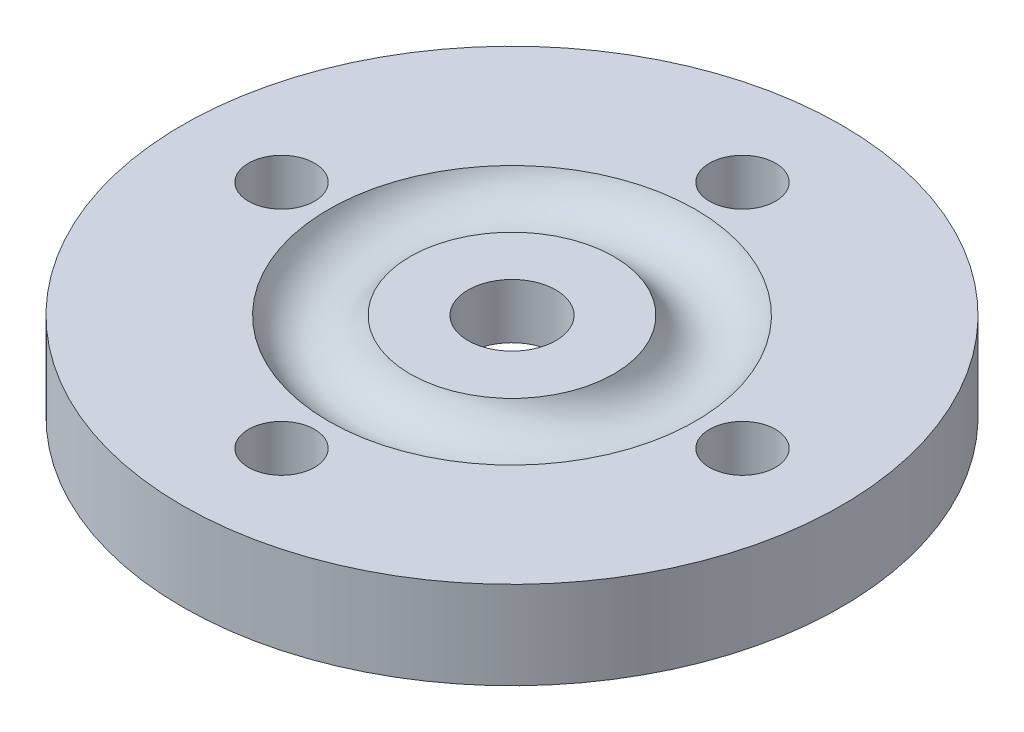
ISO-10303-21;
HEADER;
FILE_DESCRIPTION(('STEP AP214'),'2;1');
FILE_NAME('part.step','',(''),(''),'','','');
FILE_SCHEMA(('AUTOMOTIVE_DESIGN { 1 0 10303 214 1 1 1 1 }'));
ENDSEC;
DATA;
#1=APPLICATION_CONTEXT('core data for automotive mechanical design processes');
#2=APPLICATION_PROTOCOL_DEFINITION('international standard','automotive_design',2000,#1);
#3=PRODUCT_CONTEXT('',#1,'mechanical');
#4=PRODUCT('Part','Part','',(#3));
#5=PRODUCT_RELATED_PRODUCT_CATEGORY('part','',(#4));
#6=PRODUCT_DEFINITION_FORMATION('','',#4);
#7=PRODUCT_DEFINITION_CONTEXT('part definition',#1,'design');
#8=PRODUCT_DEFINITION('design','',#6,#7);
#9=PRODUCT_DEFINITION_SHAPE('','',#8);
#10=(LENGTH_UNIT() NAMED_UNIT(*) SI_UNIT(.MILLI.,.METRE.));
#11=(NAMED_UNIT(*) PLANE_ANGLE_UNIT() SI_UNIT($,.RADIAN.));
#12=(NAMED_UNIT(*) SI_UNIT($,.STERADIAN.) SOLID_ANGLE_UNIT());
#13=UNCERTAINTY_MEASURE_WITH_UNIT(LENGTH_MEASURE(1.E-05),#10,'distance_accuracy_value','');
#14=(GEOMETRIC_REPRESENTATION_CONTEXT(3) GLOBAL_UNCERTAINTY_ASSIGNED_CONTEXT((#13)) GLOBAL_UNIT_ASSIGNED_CONTEXT((#10,
#11,#12)) REPRESENTATION_CONTEXT('',''));
#15=CARTESIAN_POINT('',(0.,0.,0.));
#16=DIRECTION('',(0.,0.,1.));
#17=DIRECTION('',(1.,0.,0.));
#18=AXIS2_PLACEMENT_3D('',#15,#16,#17);
#19=CARTESIAN_POINT('',(-26.3491413562373,0.,0.));
#20=DIRECTION('',(0.,1.,0.));
#21=DIRECTION('',(0.,0.,1.));
#22=AXIS2_PLACEMENT_3D('',#19,#20,#21);
#23=PLANE('',#22);
#24=CARTESIAN_POINT('',(0.,0.,0.));
#25=DIRECTION('',(0.,1.,0.));
#26=DIRECTION('',(0.,0.,1.));
#27=AXIS2_PLACEMENT_3D('',#24,#25,#26);
#28=CIRCLE('',#27,11.9126);
#29=CARTESIAN_POINT('',(0.,0.,11.9126));
#30=VERTEX_POINT('',#29);
#31=EDGE_CURVE('E71',#30,#30,#28,.T.);
#32=ORIENTED_EDGE('',*,*,#31,.T.);
#33=EDGE_LOOP('',(#32));
#34=FACE_BOUND('',#33,.T.);
#35=CARTESIAN_POINT('',(0.,0.,-8.3312));
#36=DIRECTION('',(0.,1.,0.));
#37=DIRECTION('',(0.,0.,1.));
#38=AXIS2_PLACEMENT_3D('',#35,#36,#37);
#39=CIRCLE('',#38,1.1938);
#40=CARTESIAN_POINT('',(0.,0.,-7.1374));
#41=VERTEX_POINT('',#40);
#42=EDGE_CURVE('E68',#41,#41,#39,.T.);
#43=ORIENTED_EDGE('',*,*,#42,.F.);
#44=EDGE_LOOP('',(#43));
#45=FACE_BOUND('',#44,.T.);
#46=CARTESIAN_POINT('',(8.3312,0.,0.));
#47=DIRECTION('',(0.,1.,0.));
#48=DIRECTION('',(0.,0.,1.));
#49=AXIS2_PLACEMENT_3D('',#46,#47,#48);
#50=CIRCLE('',#49,1.1938);
#51=CARTESIAN_POINT('',(8.3312,0.,1.1938));
#52=VERTEX_POINT('',#51);
#53=EDGE_CURVE('E65',#52,#52,#50,.T.);
#54=ORIENTED_EDGE('',*,*,#53,.F.);
#55=EDGE_LOOP('',(#54));
#56=FACE_BOUND('',#55,.T.);
#57=CARTESIAN_POINT('',(0.,0.,8.3312));
#58=DIRECTION('',(0.,1.,0.));
#59=DIRECTION('',(0.,0.,1.));
#60=AXIS2_PLACEMENT_3D('',#57,#58,#59);
#61=CIRCLE('',#60,1.1938);
#62=CARTESIAN_POINT('',(0.,0.,9.525));
#63=VERTEX_POINT('',#62);
#64=EDGE_CURVE('E62',#63,#63,#61,.T.);
#65=ORIENTED_EDGE('',*,*,#64,.F.);
#66=EDGE_LOOP('',(#65));
#67=FACE_BOUND('',#66,.T.);
#68=CARTESIAN_POINT('',(-8.3312,0.,0.));
#69=DIRECTION('',(0.,1.,0.));
#70=DIRECTION('',(0.,0.,1.));
#71=AXIS2_PLACEMENT_3D('',#68,#69,#70);
#72=CIRCLE('',#71,1.1938);
#73=CARTESIAN_POINT('',(-8.3312,0.,1.1938));
#74=VERTEX_POINT('',#73);
#75=EDGE_CURVE('E47',#74,#74,#72,.T.);
#76=ORIENTED_EDGE('',*,*,#75,.F.);
#77=EDGE_LOOP('',(#76));
#78=FACE_BOUND('',#77,.T.);
#79=CARTESIAN_POINT('',(0.,0.,0.));
#80=DIRECTION('',(0.,1.,0.));
#81=DIRECTION('',(0.,0.,1.));
#82=AXIS2_PLACEMENT_3D('',#79,#80,#81);
#83=CIRCLE('',#82,6.63229844183916);
#84=CARTESIAN_POINT('',(0.,0.,6.63229844183916));
#85=VERTEX_POINT('',#84);
#86=EDGE_CURVE('E44',#85,#85,#83,.F.);
#87=ORIENTED_EDGE('',*,*,#86,.T.);
#88=EDGE_LOOP('',(#87));
#89=FACE_BOUND('',#88,.T.);
#90=ADVANCED_FACE('F24',(#34,#45,#56,#67,#78,#89),#23,.T.);
#91=CARTESIAN_POINT('',(0.,-3.175,-8.3312));
#92=DIRECTION('',(0.,1.,0.));
#93=DIRECTION('',(0.,0.,1.));
#94=AXIS2_PLACEMENT_3D('',#91,#92,#93);
#95=CYLINDRICAL_SURFACE('',#94,1.1938);
#96=CARTESIAN_POINT('',(0.,-3.175,-8.3312));
#97=DIRECTION('',(0.,1.,0.));
#98=DIRECTION('',(0.,0.,1.));
#99=AXIS2_PLACEMENT_3D('',#96,#97,#98);
#100=CIRCLE('',#99,1.1938);
#101=CARTESIAN_POINT('',(0.,-3.175,-7.1374));
#102=VERTEX_POINT('',#101);
#103=EDGE_CURVE('E32',#102,#102,#100,.T.);
#104=ORIENTED_EDGE('',*,*,#103,.F.);
#105=EDGE_LOOP('',(#104));
#106=FACE_BOUND('',#105,.T.);
#107=ORIENTED_EDGE('',*,*,#42,.T.);
#108=EDGE_LOOP('',(#107));
#109=FACE_BOUND('',#108,.T.);
#110=ADVANCED_FACE('F89',(#106,#109),#95,.F.);
#111=CARTESIAN_POINT('',(8.3312,-3.175,0.));
#112=DIRECTION('',(0.,1.,0.));
#113=DIRECTION('',(0.,0.,1.));
#114=AXIS2_PLACEMENT_3D('',#111,#112,#113);
#115=CYLINDRICAL_SURFACE('',#114,1.1938);
#116=CARTESIAN_POINT('',(8.3312,-3.175,0.));
#117=DIRECTION('',(0.,1.,0.));
#118=DIRECTION('',(0.,0.,1.));
#119=AXIS2_PLACEMENT_3D('',#116,#117,#118);
#120=CIRCLE('',#119,1.1938);
#121=CARTESIAN_POINT('',(8.3312,-3.175,1.1938));
#122=VERTEX_POINT('',#121);
#123=EDGE_CURVE('E37',#122,#122,#120,.T.);
#124=ORIENTED_EDGE('',*,*,#123,.F.);
#125=EDGE_LOOP('',(#124));
#126=FACE_BOUND('',#125,.T.);
#127=ORIENTED_EDGE('',*,*,#53,.T.);
#128=EDGE_LOOP('',(#127));
#129=FACE_BOUND('',#128,.T.);
#130=ADVANCED_FACE('F85',(#126,#129),#115,.F.);
#131=CARTESIAN_POINT('',(0.,-3.175,8.3312));
#132=DIRECTION('',(0.,1.,0.));
#133=DIRECTION('',(0.,0.,1.));
#134=AXIS2_PLACEMENT_3D('',#131,#132,#133);
#135=CYLINDRICAL_SURFACE('',#134,1.1938);
#136=CARTESIAN_POINT('',(0.,-3.175,8.3312));
#137=DIRECTION('',(0.,1.,0.));
#138=DIRECTION('',(0.,0.,1.));
#139=AXIS2_PLACEMENT_3D('',#136,#137,#138);
#140=CIRCLE('',#139,1.1938);
#141=CARTESIAN_POINT('',(0.,-3.175,9.525));
#142=VERTEX_POINT('',#141);
#143=EDGE_CURVE('E77',#142,#142,#140,.T.);
#144=ORIENTED_EDGE('',*,*,#143,.F.);
#145=EDGE_LOOP('',(#144));
#146=FACE_BOUND('',#145,.T.);
#147=ORIENTED_EDGE('',*,*,#64,.T.);
#148=EDGE_LOOP('',(#147));
#149=FACE_BOUND('',#148,.T.);
#150=ADVANCED_FACE('F88',(#146,#149),#135,.F.);
#151=CARTESIAN_POINT('',(-8.3312,-3.175,0.));
#152=DIRECTION('',(0.,1.,0.));
#153=DIRECTION('',(0.,0.,1.));
#154=AXIS2_PLACEMENT_3D('',#151,#152,#153);
#155=CYLINDRICAL_SURFACE('',#154,1.1938);
#156=CARTESIAN_POINT('',(-8.3312,-3.175,0.));
#157=DIRECTION('',(0.,1.,0.));
#158=DIRECTION('',(0.,0.,1.));
#159=AXIS2_PLACEMENT_3D('',#156,#157,#158);
#160=CIRCLE('',#159,1.1938);
#161=CARTESIAN_POINT('',(-8.3312,-3.175,1.1938));
#162=VERTEX_POINT('',#161);
#163=EDGE_CURVE('E74',#162,#162,#160,.T.);
#164=ORIENTED_EDGE('',*,*,#163,.F.);
#165=EDGE_LOOP('',(#164));
#166=FACE_BOUND('',#165,.T.);
#167=ORIENTED_EDGE('',*,*,#75,.T.);
#168=EDGE_LOOP('',(#167));
#169=FACE_BOUND('',#168,.T.);
#170=ADVANCED_FACE('F26',(#166,#169),#155,.F.);
#171=CARTESIAN_POINT('',(0.,-3.175,0.));
#172=DIRECTION('',(0.,1.,0.));
#173=DIRECTION('',(0.,0.,1.));
#174=AXIS2_PLACEMENT_3D('',#171,#172,#173);
#175=CYLINDRICAL_SURFACE('',#174,11.9126);
#176=CARTESIAN_POINT('',(0.,-3.175,0.));
#177=DIRECTION('',(0.,1.,0.));
#178=DIRECTION('',(0.,0.,1.));
#179=AXIS2_PLACEMENT_3D('',#176,#177,#178);
#180=CIRCLE('',#179,11.9126);
#181=CARTESIAN_POINT('',(0.,-3.175,11.9126));
#182=VERTEX_POINT('',#181);
#183=EDGE_CURVE('E10',#182,#182,#180,.T.);
#184=ORIENTED_EDGE('',*,*,#183,.T.);
#185=EDGE_LOOP('',(#184));
#186=FACE_BOUND('',#185,.T.);
#187=ORIENTED_EDGE('',*,*,#31,.F.);
#188=EDGE_LOOP('',(#187));
#189=FACE_BOUND('',#188,.T.);
#190=ADVANCED_FACE('F123',(#186,#189),#175,.T.);
#191=CARTESIAN_POINT('',(-26.3491413562373,-3.175,0.));
#192=DIRECTION('',(0.,1.,0.));
#193=DIRECTION('',(0.,0.,1.));
#194=AXIS2_PLACEMENT_3D('',#191,#192,#193);
#195=PLANE('',#194);
#196=CARTESIAN_POINT('',(0.,-3.175,0.));
#197=DIRECTION('',(0.,1.,0.));
#198=DIRECTION('',(0.,0.,1.));
#199=AXIS2_PLACEMENT_3D('',#196,#197,#198);
#200=CIRCLE('',#199,3.5687);
#201=CARTESIAN_POINT('',(0.,-3.175,3.5687));
#202=VERTEX_POINT('',#201);
#203=EDGE_CURVE('E45',#202,#202,#200,.T.);
#204=ORIENTED_EDGE('',*,*,#203,.T.);
#205=EDGE_LOOP('',(#204));
#206=FACE_BOUND('',#205,.T.);
#207=ORIENTED_EDGE('',*,*,#163,.T.);
#208=EDGE_LOOP('',(#207));
#209=FACE_BOUND('',#208,.T.);
#210=ORIENTED_EDGE('',*,*,#143,.T.);
#211=EDGE_LOOP('',(#210));
#212=FACE_BOUND('',#211,.T.);
#213=ORIENTED_EDGE('',*,*,#123,.T.);
#214=EDGE_LOOP('',(#213));
#215=FACE_BOUND('',#214,.T.);
#216=ORIENTED_EDGE('',*,*,#103,.T.);
#217=EDGE_LOOP('',(#216));
#218=FACE_BOUND('',#217,.T.);
#219=ORIENTED_EDGE('',*,*,#183,.F.);
#220=EDGE_LOOP('',(#219));
#221=FACE_BOUND('',#220,.T.);
#222=ADVANCED_FACE('F82',(#206,#209,#212,#215,#218,#221),#195,.F.);
#223=CARTESIAN_POINT('',(0.,0.584199999999999,0.));
#224=DIRECTION('',(0.,1.,0.));
#225=DIRECTION('',(0.,0.,1.));
#226=AXIS2_PLACEMENT_3D('',#223,#224,#225);
#227=TOROIDAL_SURFACE('',#226,5.1562,1.5875);
#228=ORIENTED_EDGE('',*,*,#86,.F.);
#229=EDGE_LOOP('',(#228));
#230=FACE_BOUND('',#229,.T.);
#231=CARTESIAN_POINT('',(0.,0.,0.));
#232=DIRECTION('',(0.,-1.,0.));
#233=DIRECTION('',(0.,0.,-1.));
#234=AXIS2_PLACEMENT_3D('',#231,#232,#233);
#235=CIRCLE('',#234,3.68010155816084);
#236=CARTESIAN_POINT('',(0.,0.,-3.68010155816084));
#237=VERTEX_POINT('',#236);
#238=EDGE_CURVE('E41',#237,#237,#235,.F.);
#239=ORIENTED_EDGE('',*,*,#238,.F.);
#240=EDGE_LOOP('',(#239));
#241=FACE_BOUND('',#240,.T.);
#242=ADVANCED_FACE('F104',(#230,#241),#227,.F.);
#243=CARTESIAN_POINT('',(0.,0.,0.));
#244=DIRECTION('',(0.,1.,0.));
#245=DIRECTION('',(0.,0.,1.));
#246=AXIS2_PLACEMENT_3D('',#243,#244,#245);
#247=CIRCLE('',#246,1.5875);
#248=CARTESIAN_POINT('',(0.,0.,1.5875));
#249=VERTEX_POINT('',#248);
#250=EDGE_CURVE('E57',#249,#249,#247,.T.);
#251=ORIENTED_EDGE('',*,*,#250,.F.);
#252=EDGE_LOOP('',(#251));
#253=FACE_BOUND('',#252,.T.);
#254=ORIENTED_EDGE('',*,*,#238,.T.);
#255=EDGE_LOOP('',(#254));
#256=FACE_BOUND('',#255,.T.);
#257=ADVANCED_FACE('F97',(#253,#256),#23,.T.);
#258=CARTESIAN_POINT('',(0.,-5.1562,0.));
#259=DIRECTION('',(0.,1.,0.));
#260=DIRECTION('',(0.,0.,1.));
#261=AXIS2_PLACEMENT_3D('',#258,#259,#260);
#262=CYLINDRICAL_SURFACE('',#261,3.5687);
#263=CARTESIAN_POINT('',(0.,-1.9812,0.));
#264=DIRECTION('',(0.,1.,0.));
#265=DIRECTION('',(0.,0.,1.));
#266=AXIS2_PLACEMENT_3D('',#263,#264,#265);
#267=CIRCLE('',#266,3.5687);
#268=CARTESIAN_POINT('',(0.,-1.9812,3.5687));
#269=VERTEX_POINT('',#268);
#270=EDGE_CURVE('E49',#269,#269,#267,.T.);
#271=ORIENTED_EDGE('',*,*,#270,.T.);
#272=EDGE_LOOP('',(#271));
#273=FACE_BOUND('',#272,.T.);
#274=ORIENTED_EDGE('',*,*,#203,.F.);
#275=EDGE_LOOP('',(#274));
#276=FACE_BOUND('',#275,.T.);
#277=ADVANCED_FACE('F111',(#273,#276),#262,.F.);
#278=CARTESIAN_POINT('',(-26.3491413562373,-1.9812,0.));
#279=DIRECTION('',(0.,1.,0.));
#280=DIRECTION('',(0.,0.,1.));
#281=AXIS2_PLACEMENT_3D('',#278,#279,#280);
#282=PLANE('',#281);
#283=CARTESIAN_POINT('',(0.,-1.9812,0.));
#284=DIRECTION('',(0.,1.,0.));
#285=DIRECTION('',(0.,0.,1.));
#286=AXIS2_PLACEMENT_3D('',#283,#284,#285);
#287=CIRCLE('',#286,1.5875);
#288=CARTESIAN_POINT('',(0.,-1.9812,1.5875));
#289=VERTEX_POINT('',#288);
#290=EDGE_CURVE('E28',#289,#289,#287,.T.);
#291=ORIENTED_EDGE('',*,*,#290,.T.);
#292=EDGE_LOOP('',(#291));
#293=FACE_BOUND('',#292,.T.);
#294=ORIENTED_EDGE('',*,*,#270,.F.);
#295=EDGE_LOOP('',(#294));
#296=FACE_BOUND('',#295,.T.);
#297=ADVANCED_FACE('F117',(#293,#296),#282,.F.);
#298=CARTESIAN_POINT('',(0.,-3.175,0.));
#299=DIRECTION('',(0.,1.,0.));
#300=DIRECTION('',(0.,0.,1.));
#301=AXIS2_PLACEMENT_3D('',#298,#299,#300);
#302=CYLINDRICAL_SURFACE('',#301,1.5875);
#303=ORIENTED_EDGE('',*,*,#250,.T.);
#304=EDGE_LOOP('',(#303));
#305=FACE_BOUND('',#304,.T.);
#306=ORIENTED_EDGE('',*,*,#290,.F.);
#307=EDGE_LOOP('',(#306));
#308=FACE_BOUND('',#307,.T.);
#309=ADVANCED_FACE('F168',(#305,#308),#302,.F.);
#310=CLOSED_SHELL('',(#90,#110,#130,#150,#170,#190,#222,#242,#257,#277,#297,#309));
#311=MANIFOLD_SOLID_BREP('B2',#310);
#312=ADVANCED_BREP_SHAPE_REPRESENTATION('',(#18,#311),#14);
#313=SHAPE_DEFINITION_REPRESENTATION(#9,#312);
ENDSEC;
END-ISO-10303-21;
